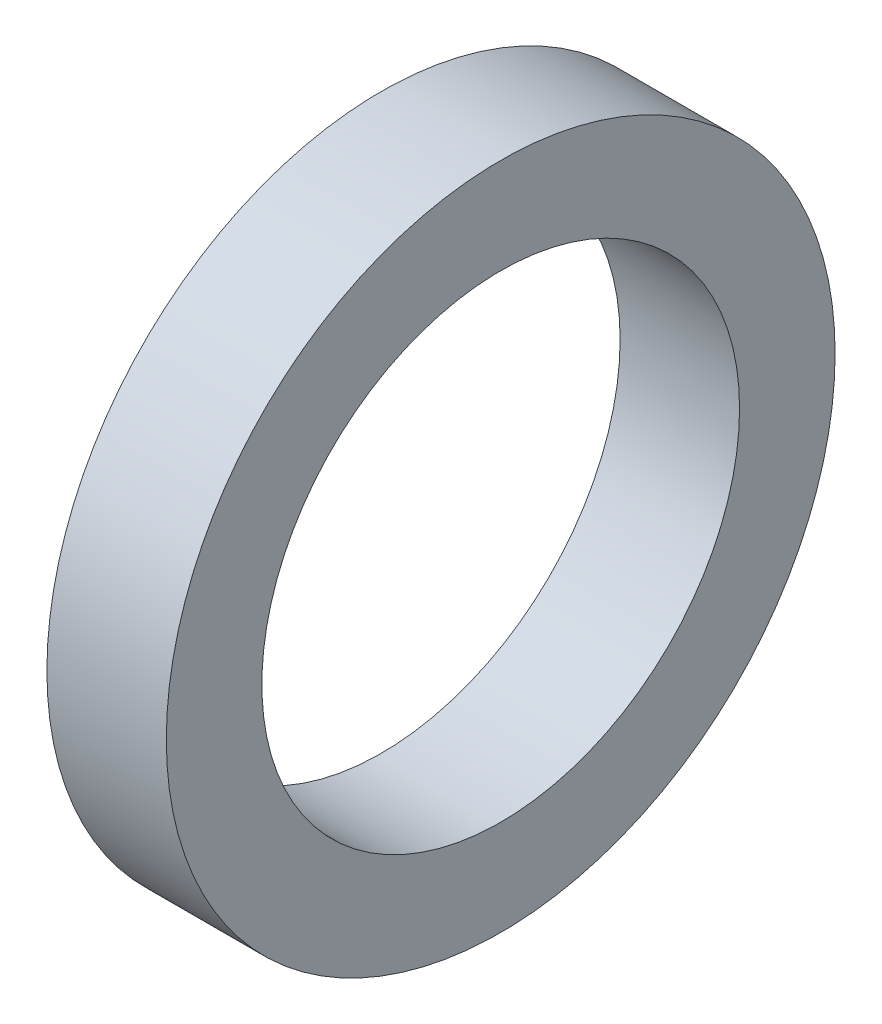
ISO-10303-21;
HEADER;
FILE_DESCRIPTION(('STEP AP214'),'2;1');
FILE_NAME('part.step','',(''),(''),'','','');
FILE_SCHEMA(('AUTOMOTIVE_DESIGN { 1 0 10303 214 1 1 1 1 }'));
ENDSEC;
DATA;
#1=APPLICATION_CONTEXT('core data for automotive mechanical design processes');
#2=APPLICATION_PROTOCOL_DEFINITION('international standard','automotive_design',2000,#1);
#3=PRODUCT_CONTEXT('',#1,'mechanical');
#4=PRODUCT('Part','Part','',(#3));
#5=PRODUCT_RELATED_PRODUCT_CATEGORY('part','',(#4));
#6=PRODUCT_DEFINITION_FORMATION('','',#4);
#7=PRODUCT_DEFINITION_CONTEXT('part definition',#1,'design');
#8=PRODUCT_DEFINITION('design','',#6,#7);
#9=PRODUCT_DEFINITION_SHAPE('','',#8);
#10=(LENGTH_UNIT() NAMED_UNIT(*) SI_UNIT(.MILLI.,.METRE.));
#11=(NAMED_UNIT(*) PLANE_ANGLE_UNIT() SI_UNIT($,.RADIAN.));
#12=(NAMED_UNIT(*) SI_UNIT($,.STERADIAN.) SOLID_ANGLE_UNIT());
#13=UNCERTAINTY_MEASURE_WITH_UNIT(LENGTH_MEASURE(1.E-05),#10,'distance_accuracy_value','');
#14=(GEOMETRIC_REPRESENTATION_CONTEXT(3) GLOBAL_UNCERTAINTY_ASSIGNED_CONTEXT((#13)) GLOBAL_UNIT_ASSIGNED_CONTEXT((#10,
#11,#12)) REPRESENTATION_CONTEXT('',''));
#15=CARTESIAN_POINT('',(0.,0.,0.));
#16=DIRECTION('',(0.,0.,1.));
#17=DIRECTION('',(1.,0.,0.));
#18=AXIS2_PLACEMENT_3D('',#15,#16,#17);
#19=CARTESIAN_POINT('',(3.175,0.,0.));
#20=DIRECTION('',(1.,0.,0.));
#21=DIRECTION('',(0.,0.,-1.));
#22=AXIS2_PLACEMENT_3D('',#19,#20,#21);
#23=PLANE('',#22);
#24=CARTESIAN_POINT('',(3.175,0.,0.));
#25=DIRECTION('',(1.,0.,0.));
#26=DIRECTION('',(0.,0.,-1.));
#27=AXIS2_PLACEMENT_3D('',#24,#25,#26);
#28=CIRCLE('',#27,8.89);
#29=CARTESIAN_POINT('',(3.175,0.,-8.89));
#30=VERTEX_POINT('',#29);
#31=EDGE_CURVE('E10',#30,#30,#28,.T.);
#32=ORIENTED_EDGE('',*,*,#31,.T.);
#33=EDGE_LOOP('',(#32));
#34=FACE_BOUND('',#33,.T.);
#35=CARTESIAN_POINT('',(3.175,0.,0.));
#36=DIRECTION('',(1.,0.,0.));
#37=DIRECTION('',(0.,0.,-1.));
#38=AXIS2_PLACEMENT_3D('',#35,#36,#37);
#39=CIRCLE('',#38,6.35);
#40=CARTESIAN_POINT('',(3.175,0.,-6.35));
#41=VERTEX_POINT('',#40);
#42=EDGE_CURVE('E42',#41,#41,#39,.T.);
#43=ORIENTED_EDGE('',*,*,#42,.F.);
#44=EDGE_LOOP('',(#43));
#45=FACE_BOUND('',#44,.T.);
#46=ADVANCED_FACE('F31',(#34,#45),#23,.T.);
#47=CARTESIAN_POINT('',(0.,0.,0.));
#48=DIRECTION('',(1.,0.,0.));
#49=DIRECTION('',(0.,0.,-1.));
#50=AXIS2_PLACEMENT_3D('',#47,#48,#49);
#51=PLANE('',#50);
#52=CARTESIAN_POINT('',(0.,0.,0.));
#53=DIRECTION('',(1.,0.,0.));
#54=DIRECTION('',(0.,0.,-1.));
#55=AXIS2_PLACEMENT_3D('',#52,#53,#54);
#56=CIRCLE('',#55,8.89);
#57=CARTESIAN_POINT('',(0.,0.,-8.89));
#58=VERTEX_POINT('',#57);
#59=EDGE_CURVE('E35',#58,#58,#56,.T.);
#60=ORIENTED_EDGE('',*,*,#59,.F.);
#61=EDGE_LOOP('',(#60));
#62=FACE_BOUND('',#61,.T.);
#63=CARTESIAN_POINT('',(0.,0.,0.));
#64=DIRECTION('',(1.,0.,0.));
#65=DIRECTION('',(0.,0.,-1.));
#66=AXIS2_PLACEMENT_3D('',#63,#64,#65);
#67=CIRCLE('',#66,6.35);
#68=CARTESIAN_POINT('',(0.,0.,-6.35));
#69=VERTEX_POINT('',#68);
#70=EDGE_CURVE('E44',#69,#69,#67,.T.);
#71=ORIENTED_EDGE('',*,*,#70,.T.);
#72=EDGE_LOOP('',(#71));
#73=FACE_BOUND('',#72,.T.);
#74=ADVANCED_FACE('F54',(#62,#73),#51,.F.);
#75=CARTESIAN_POINT('',(3.175,0.,0.));
#76=DIRECTION('',(-1.,0.,0.));
#77=DIRECTION('',(0.,0.,1.));
#78=AXIS2_PLACEMENT_3D('',#75,#76,#77);
#79=CYLINDRICAL_SURFACE('',#78,8.89);
#80=ORIENTED_EDGE('',*,*,#31,.F.);
#81=EDGE_LOOP('',(#80));
#82=FACE_BOUND('',#81,.T.);
#83=ORIENTED_EDGE('',*,*,#59,.T.);
#84=EDGE_LOOP('',(#83));
#85=FACE_BOUND('',#84,.T.);
#86=ADVANCED_FACE('F33',(#82,#85),#79,.T.);
#87=CARTESIAN_POINT('',(3.175,0.,0.));
#88=DIRECTION('',(-1.,0.,0.));
#89=DIRECTION('',(0.,0.,1.));
#90=AXIS2_PLACEMENT_3D('',#87,#88,#89);
#91=CYLINDRICAL_SURFACE('',#90,6.35);
#92=ORIENTED_EDGE('',*,*,#42,.T.);
#93=EDGE_LOOP('',(#92));
#94=FACE_BOUND('',#93,.T.);
#95=ORIENTED_EDGE('',*,*,#70,.F.);
#96=EDGE_LOOP('',(#95));
#97=FACE_BOUND('',#96,.T.);
#98=ADVANCED_FACE('F50',(#94,#97),#91,.F.);
#99=CLOSED_SHELL('',(#46,#74,#86,#98));
#100=MANIFOLD_SOLID_BREP('B2',#99);
#101=ADVANCED_BREP_SHAPE_REPRESENTATION('',(#18,#100),#14);
#102=SHAPE_DEFINITION_REPRESENTATION(#9,#101);
ENDSEC;
END-ISO-10303-21;
